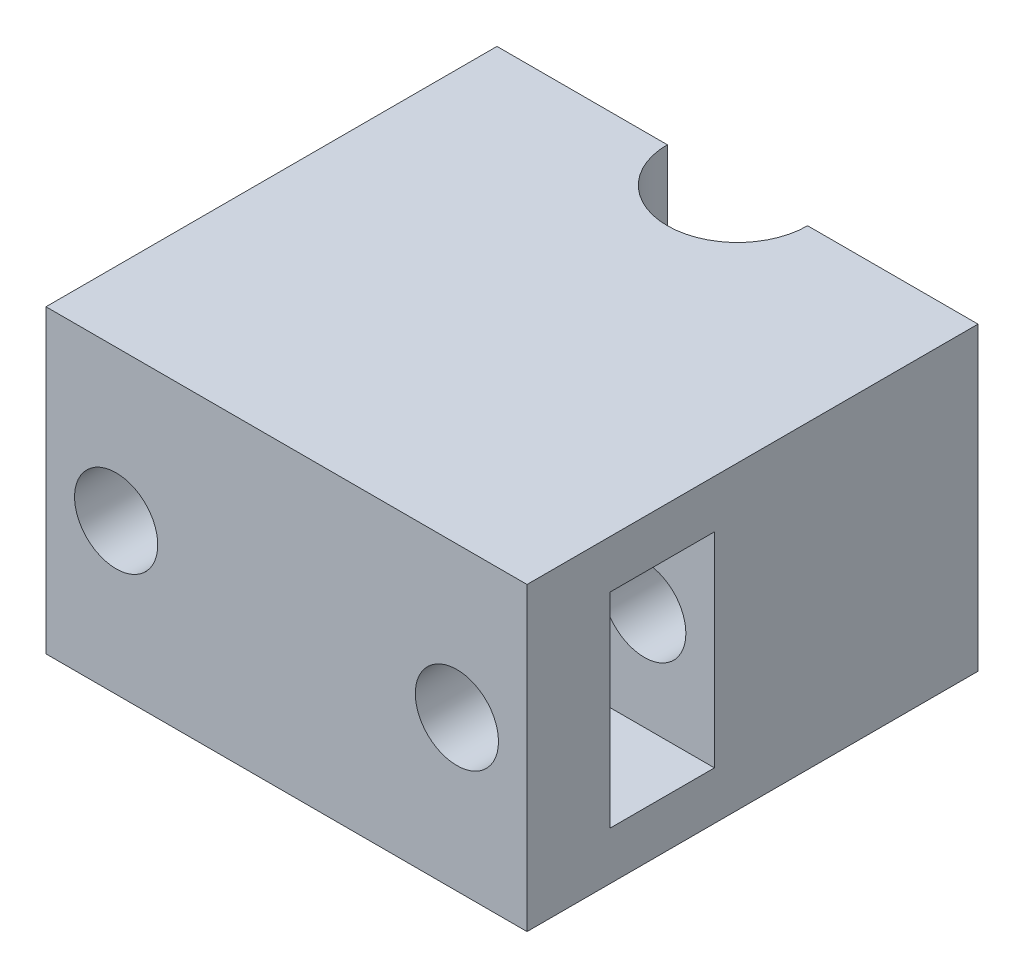
ISO-10303-21;
HEADER;
FILE_DESCRIPTION(('STEP AP214'),'2;1');
FILE_NAME('part.step','',(''),(''),'','','');
FILE_SCHEMA(('AUTOMOTIVE_DESIGN { 1 0 10303 214 1 1 1 1 }'));
ENDSEC;
DATA;
#1=APPLICATION_CONTEXT('core data for automotive mechanical design processes');
#2=APPLICATION_PROTOCOL_DEFINITION('international standard','automotive_design',2000,#1);
#3=PRODUCT_CONTEXT('',#1,'mechanical');
#4=PRODUCT('Part','Part','',(#3));
#5=PRODUCT_RELATED_PRODUCT_CATEGORY('part','',(#4));
#6=PRODUCT_DEFINITION_FORMATION('','',#4);
#7=PRODUCT_DEFINITION_CONTEXT('part definition',#1,'design');
#8=PRODUCT_DEFINITION('design','',#6,#7);
#9=PRODUCT_DEFINITION_SHAPE('','',#8);
#10=(LENGTH_UNIT() NAMED_UNIT(*) SI_UNIT(.MILLI.,.METRE.));
#11=(NAMED_UNIT(*) PLANE_ANGLE_UNIT() SI_UNIT($,.RADIAN.));
#12=(NAMED_UNIT(*) SI_UNIT($,.STERADIAN.) SOLID_ANGLE_UNIT());
#13=UNCERTAINTY_MEASURE_WITH_UNIT(LENGTH_MEASURE(1.E-05),#10,'distance_accuracy_value','');
#14=(GEOMETRIC_REPRESENTATION_CONTEXT(3) GLOBAL_UNCERTAINTY_ASSIGNED_CONTEXT((#13)) GLOBAL_UNIT_ASSIGNED_CONTEXT((#10,
#11,#12)) REPRESENTATION_CONTEXT('',''));
#15=CARTESIAN_POINT('',(0.,0.,0.));
#16=DIRECTION('',(0.,0.,1.));
#17=DIRECTION('',(1.,0.,0.));
#18=AXIS2_PLACEMENT_3D('',#15,#16,#17);
#19=CARTESIAN_POINT('',(24.,30.,-22.5));
#20=DIRECTION('',(0.,0.,1.));
#21=DIRECTION('',(1.,0.,0.));
#22=AXIS2_PLACEMENT_3D('',#19,#20,#21);
#23=PLANE('',#22);
#24=CARTESIAN_POINT('',(-17.,15.,-22.5));
#25=DIRECTION('',(0.,0.,1.));
#26=DIRECTION('',(1.,0.,0.));
#27=AXIS2_PLACEMENT_3D('',#24,#25,#26);
#28=CIRCLE('',#27,4.15);
#29=CARTESIAN_POINT('',(-12.85,15.,-22.5));
#30=VERTEX_POINT('',#29);
#31=EDGE_CURVE('E159',#30,#30,#28,.T.);
#32=ORIENTED_EDGE('',*,*,#31,.T.);
#33=EDGE_LOOP('',(#32));
#34=FACE_BOUND('',#33,.T.);
#35=DIRECTION('',(0.,-1.,0.));
#36=VECTOR('',#35,1.);
#37=CARTESIAN_POINT('',(-7.,137.757696924736,-22.5));
#38=LINE('',#37,#36);
#39=CARTESIAN_POINT('',(-7.,30.,-22.5));
#40=VERTEX_POINT('',#39);
#41=CARTESIAN_POINT('',(-7.,0.,-22.5));
#42=VERTEX_POINT('',#41);
#43=EDGE_CURVE('E140',#40,#42,#38,.T.);
#44=ORIENTED_EDGE('',*,*,#43,.T.);
#45=DIRECTION('',(-1.,0.,0.));
#46=VECTOR('',#45,1.);
#47=CARTESIAN_POINT('',(24.,0.,-22.5));
#48=LINE('',#47,#46);
#49=CARTESIAN_POINT('',(-24.,0.,-22.5));
#50=VERTEX_POINT('',#49);
#51=EDGE_CURVE('E127',#42,#50,#48,.T.);
#52=ORIENTED_EDGE('',*,*,#51,.T.);
#53=DIRECTION('',(0.,-1.,0.));
#54=VECTOR('',#53,1.);
#55=CARTESIAN_POINT('',(-24.,30.,-22.5));
#56=LINE('',#55,#54);
#57=CARTESIAN_POINT('',(-24.,30.,-22.5));
#58=VERTEX_POINT('',#57);
#59=EDGE_CURVE('E211',#58,#50,#56,.T.);
#60=ORIENTED_EDGE('',*,*,#59,.F.);
#61=DIRECTION('',(-1.,0.,0.));
#62=VECTOR('',#61,1.);
#63=CARTESIAN_POINT('',(24.,30.,-22.5));
#64=LINE('',#63,#62);
#65=EDGE_CURVE('E141',#40,#58,#64,.T.);
#66=ORIENTED_EDGE('',*,*,#65,.F.);
#67=EDGE_LOOP('',(#44,#52,#60,#66));
#68=FACE_BOUND('',#67,.T.);
#69=ADVANCED_FACE('F37',(#34,#68),#23,.F.);
#70=CARTESIAN_POINT('',(17.,15.,-22.5));
#71=DIRECTION('',(0.,0.,1.));
#72=DIRECTION('',(1.,0.,0.));
#73=AXIS2_PLACEMENT_3D('',#70,#71,#72);
#74=CIRCLE('',#73,4.15);
#75=CARTESIAN_POINT('',(21.15,15.,-22.5));
#76=VERTEX_POINT('',#75);
#77=EDGE_CURVE('E149',#76,#76,#74,.T.);
#78=ORIENTED_EDGE('',*,*,#77,.T.);
#79=EDGE_LOOP('',(#78));
#80=FACE_BOUND('',#79,.T.);
#81=DIRECTION('',(0.,-1.,0.));
#82=VECTOR('',#81,1.);
#83=CARTESIAN_POINT('',(7.,137.757696924736,-22.5));
#84=LINE('',#83,#82);
#85=CARTESIAN_POINT('',(7.,30.,-22.5));
#86=VERTEX_POINT('',#85);
#87=CARTESIAN_POINT('',(7.,0.,-22.5));
#88=VERTEX_POINT('',#87);
#89=EDGE_CURVE('E60',#86,#88,#84,.T.);
#90=ORIENTED_EDGE('',*,*,#89,.F.);
#91=CARTESIAN_POINT('',(24.,30.,-22.5));
#92=VERTEX_POINT('',#91);
#93=EDGE_CURVE('E209',#92,#86,#64,.T.);
#94=ORIENTED_EDGE('',*,*,#93,.F.);
#95=DIRECTION('',(0.,-1.,0.));
#96=VECTOR('',#95,1.);
#97=CARTESIAN_POINT('',(24.,30.,-22.5));
#98=LINE('',#97,#96);
#99=CARTESIAN_POINT('',(24.,0.,-22.5));
#100=VERTEX_POINT('',#99);
#101=EDGE_CURVE('E217',#92,#100,#98,.T.);
#102=ORIENTED_EDGE('',*,*,#101,.T.);
#103=EDGE_CURVE('E136',#100,#88,#48,.T.);
#104=ORIENTED_EDGE('',*,*,#103,.T.);
#105=EDGE_LOOP('',(#90,#94,#102,#104));
#106=FACE_BOUND('',#105,.T.);
#107=ADVANCED_FACE('F250',(#80,#106),#23,.F.);
#108=CARTESIAN_POINT('',(0.,30.,0.));
#109=DIRECTION('',(0.,1.,0.));
#110=DIRECTION('',(0.,0.,1.));
#111=AXIS2_PLACEMENT_3D('',#108,#109,#110);
#112=PLANE('',#111);
#113=ORIENTED_EDGE('',*,*,#93,.T.);
#114=CARTESIAN_POINT('',(0.,30.,-22.5));
#115=DIRECTION('',(0.,1.,0.));
#116=DIRECTION('',(0.,0.,1.));
#117=AXIS2_PLACEMENT_3D('',#114,#115,#116);
#118=CIRCLE('',#117,7.);
#119=EDGE_CURVE('E52',#86,#40,#118,.F.);
#120=ORIENTED_EDGE('',*,*,#119,.T.);
#121=ORIENTED_EDGE('',*,*,#65,.T.);
#122=DIRECTION('',(0.,0.,1.));
#123=VECTOR('',#122,1.);
#124=CARTESIAN_POINT('',(-24.,30.,22.5));
#125=LINE('',#124,#123);
#126=CARTESIAN_POINT('',(-24.,30.,22.5));
#127=VERTEX_POINT('',#126);
#128=EDGE_CURVE('E202',#58,#127,#125,.T.);
#129=ORIENTED_EDGE('',*,*,#128,.T.);
#130=DIRECTION('',(1.,0.,0.));
#131=VECTOR('',#130,1.);
#132=CARTESIAN_POINT('',(24.,30.,22.5));
#133=LINE('',#132,#131);
#134=CARTESIAN_POINT('',(24.,30.,22.5));
#135=VERTEX_POINT('',#134);
#136=EDGE_CURVE('E205',#127,#135,#133,.T.);
#137=ORIENTED_EDGE('',*,*,#136,.T.);
#138=DIRECTION('',(0.,0.,-1.));
#139=VECTOR('',#138,1.);
#140=CARTESIAN_POINT('',(24.,30.,22.5));
#141=LINE('',#140,#139);
#142=EDGE_CURVE('E207',#135,#92,#141,.T.);
#143=ORIENTED_EDGE('',*,*,#142,.T.);
#144=EDGE_LOOP('',(#113,#120,#121,#129,#137,#143));
#145=FACE_BOUND('',#144,.T.);
#146=ADVANCED_FACE('F256',(#145),#112,.T.);
#147=CARTESIAN_POINT('',(0.,0.,0.));
#148=DIRECTION('',(0.,1.,0.));
#149=DIRECTION('',(0.,0.,1.));
#150=AXIS2_PLACEMENT_3D('',#147,#148,#149);
#151=PLANE('',#150);
#152=CARTESIAN_POINT('',(0.,0.,-22.5));
#153=DIRECTION('',(0.,1.,0.));
#154=DIRECTION('',(0.,0.,1.));
#155=AXIS2_PLACEMENT_3D('',#152,#153,#154);
#156=CIRCLE('',#155,7.);
#157=EDGE_CURVE('E12',#88,#42,#156,.F.);
#158=ORIENTED_EDGE('',*,*,#157,.F.);
#159=ORIENTED_EDGE('',*,*,#103,.F.);
#160=DIRECTION('',(0.,0.,-1.));
#161=VECTOR('',#160,1.);
#162=CARTESIAN_POINT('',(24.,0.,22.5));
#163=LINE('',#162,#161);
#164=CARTESIAN_POINT('',(24.,0.,22.5));
#165=VERTEX_POINT('',#164);
#166=EDGE_CURVE('E137',#165,#100,#163,.T.);
#167=ORIENTED_EDGE('',*,*,#166,.F.);
#168=DIRECTION('',(1.,0.,0.));
#169=VECTOR('',#168,1.);
#170=CARTESIAN_POINT('',(24.,0.,22.5));
#171=LINE('',#170,#169);
#172=CARTESIAN_POINT('',(-24.,0.,22.5));
#173=VERTEX_POINT('',#172);
#174=EDGE_CURVE('E213',#173,#165,#171,.T.);
#175=ORIENTED_EDGE('',*,*,#174,.F.);
#176=DIRECTION('',(0.,0.,1.));
#177=VECTOR('',#176,1.);
#178=CARTESIAN_POINT('',(-24.,0.,22.5));
#179=LINE('',#178,#177);
#180=EDGE_CURVE('E132',#50,#173,#179,.T.);
#181=ORIENTED_EDGE('',*,*,#180,.F.);
#182=ORIENTED_EDGE('',*,*,#51,.F.);
#183=EDGE_LOOP('',(#158,#159,#167,#175,#181,#182));
#184=FACE_BOUND('',#183,.T.);
#185=ADVANCED_FACE('F129',(#184),#151,.F.);
#186=CARTESIAN_POINT('',(-21.,30.,22.5));
#187=DIRECTION('',(1.,0.,0.));
#188=DIRECTION('',(0.,0.,-1.));
#189=AXIS2_PLACEMENT_3D('',#186,#187,#188);
#190=PLANE('',#189);
#191=DIRECTION('',(0.,0.,1.));
#192=VECTOR('',#191,1.);
#193=CARTESIAN_POINT('',(-21.,16.1056672193749,-22.5));
#194=LINE('',#193,#192);
#195=CARTESIAN_POINT('',(-21.,16.1056672193749,3.80000000000001));
#196=VERTEX_POINT('',#195);
#197=CARTESIAN_POINT('',(-21.,16.1056672193749,14.2));
#198=VERTEX_POINT('',#197);
#199=EDGE_CURVE('E45',#196,#198,#194,.T.);
#200=ORIENTED_EDGE('',*,*,#199,.F.);
#201=DIRECTION('',(0.,-1.,0.));
#202=VECTOR('',#201,1.);
#203=CARTESIAN_POINT('',(-21.,4.8,3.80000000000001));
#204=LINE('',#203,#202);
#205=CARTESIAN_POINT('',(-21.,25.2,3.80000000000001));
#206=VERTEX_POINT('',#205);
#207=EDGE_CURVE('E178',#206,#196,#204,.T.);
#208=ORIENTED_EDGE('',*,*,#207,.F.);
#209=DIRECTION('',(0.,0.,-1.));
#210=VECTOR('',#209,1.);
#211=CARTESIAN_POINT('',(-21.,25.2,14.2));
#212=LINE('',#211,#210);
#213=CARTESIAN_POINT('',(-21.,25.2,14.2));
#214=VERTEX_POINT('',#213);
#215=EDGE_CURVE('E181',#214,#206,#212,.T.);
#216=ORIENTED_EDGE('',*,*,#215,.F.);
#217=DIRECTION('',(0.,1.,0.));
#218=VECTOR('',#217,1.);
#219=CARTESIAN_POINT('',(-21.,4.8,14.2));
#220=LINE('',#219,#218);
#221=EDGE_CURVE('E175',#198,#214,#220,.T.);
#222=ORIENTED_EDGE('',*,*,#221,.F.);
#223=EDGE_LOOP('',(#200,#208,#216,#222));
#224=FACE_BOUND('',#223,.T.);
#225=ADVANCED_FACE('F271',(#224),#190,.T.);
#226=CARTESIAN_POINT('',(-24.,30.,22.5));
#227=DIRECTION('',(1.,0.,0.));
#228=DIRECTION('',(0.,0.,-1.));
#229=AXIS2_PLACEMENT_3D('',#226,#227,#228);
#230=PLANE('',#229);
#231=ORIENTED_EDGE('',*,*,#180,.T.);
#232=DIRECTION('',(0.,-1.,0.));
#233=VECTOR('',#232,1.);
#234=CARTESIAN_POINT('',(-24.,30.,22.5));
#235=LINE('',#234,#233);
#236=EDGE_CURVE('E223',#127,#173,#235,.T.);
#237=ORIENTED_EDGE('',*,*,#236,.F.);
#238=ORIENTED_EDGE('',*,*,#128,.F.);
#239=ORIENTED_EDGE('',*,*,#59,.T.);
#240=EDGE_LOOP('',(#231,#237,#238,#239));
#241=FACE_BOUND('',#240,.T.);
#242=ADVANCED_FACE('F39',(#241),#230,.F.);
#243=CARTESIAN_POINT('',(24.,30.,22.5));
#244=DIRECTION('',(0.,0.,-1.));
#245=DIRECTION('',(-1.,0.,0.));
#246=AXIS2_PLACEMENT_3D('',#243,#244,#245);
#247=PLANE('',#246);
#248=CARTESIAN_POINT('',(17.,15.,22.5));
#249=DIRECTION('',(0.,0.,1.));
#250=DIRECTION('',(1.,0.,0.));
#251=AXIS2_PLACEMENT_3D('',#248,#249,#250);
#252=CIRCLE('',#251,4.15);
#253=CARTESIAN_POINT('',(21.15,15.,22.5));
#254=VERTEX_POINT('',#253);
#255=EDGE_CURVE('E146',#254,#254,#252,.T.);
#256=ORIENTED_EDGE('',*,*,#255,.F.);
#257=EDGE_LOOP('',(#256));
#258=FACE_BOUND('',#257,.T.);
#259=CARTESIAN_POINT('',(-17.,15.,22.5));
#260=DIRECTION('',(0.,0.,1.));
#261=DIRECTION('',(1.,0.,0.));
#262=AXIS2_PLACEMENT_3D('',#259,#260,#261);
#263=CIRCLE('',#262,4.15);
#264=CARTESIAN_POINT('',(-12.85,15.,22.5));
#265=VERTEX_POINT('',#264);
#266=EDGE_CURVE('E158',#265,#265,#263,.T.);
#267=ORIENTED_EDGE('',*,*,#266,.F.);
#268=EDGE_LOOP('',(#267));
#269=FACE_BOUND('',#268,.T.);
#270=ORIENTED_EDGE('',*,*,#174,.T.);
#271=DIRECTION('',(0.,-1.,0.));
#272=VECTOR('',#271,1.);
#273=CARTESIAN_POINT('',(24.,30.,22.5));
#274=LINE('',#273,#272);
#275=EDGE_CURVE('E220',#135,#165,#274,.T.);
#276=ORIENTED_EDGE('',*,*,#275,.F.);
#277=ORIENTED_EDGE('',*,*,#136,.F.);
#278=ORIENTED_EDGE('',*,*,#236,.T.);
#279=EDGE_LOOP('',(#270,#276,#277,#278));
#280=FACE_BOUND('',#279,.T.);
#281=ADVANCED_FACE('F264',(#258,#269,#280),#247,.F.);
#282=CARTESIAN_POINT('',(24.,30.,22.5));
#283=DIRECTION('',(-1.,0.,0.));
#284=DIRECTION('',(0.,0.,1.));
#285=AXIS2_PLACEMENT_3D('',#282,#283,#284);
#286=PLANE('',#285);
#287=DIRECTION('',(0.,0.,1.));
#288=VECTOR('',#287,1.);
#289=CARTESIAN_POINT('',(24.,25.2,14.2));
#290=LINE('',#289,#288);
#291=CARTESIAN_POINT('',(24.,25.2,3.80000000000001));
#292=VERTEX_POINT('',#291);
#293=CARTESIAN_POINT('',(24.,25.2,14.2));
#294=VERTEX_POINT('',#293);
#295=EDGE_CURVE('E183',#292,#294,#290,.T.);
#296=ORIENTED_EDGE('',*,*,#295,.F.);
#297=DIRECTION('',(0.,1.,0.));
#298=VECTOR('',#297,1.);
#299=CARTESIAN_POINT('',(24.,4.8,3.80000000000001));
#300=LINE('',#299,#298);
#301=CARTESIAN_POINT('',(24.,4.8,3.80000000000001));
#302=VERTEX_POINT('',#301);
#303=EDGE_CURVE('E170',#302,#292,#300,.T.);
#304=ORIENTED_EDGE('',*,*,#303,.F.);
#305=DIRECTION('',(0.,0.,-1.));
#306=VECTOR('',#305,1.);
#307=CARTESIAN_POINT('',(24.,4.8,14.2));
#308=LINE('',#307,#306);
#309=CARTESIAN_POINT('',(24.,4.8,14.2));
#310=VERTEX_POINT('',#309);
#311=EDGE_CURVE('E189',#310,#302,#308,.T.);
#312=ORIENTED_EDGE('',*,*,#311,.F.);
#313=DIRECTION('',(0.,-1.,0.));
#314=VECTOR('',#313,1.);
#315=CARTESIAN_POINT('',(24.,4.8,14.2));
#316=LINE('',#315,#314);
#317=EDGE_CURVE('E186',#294,#310,#316,.T.);
#318=ORIENTED_EDGE('',*,*,#317,.F.);
#319=EDGE_LOOP('',(#296,#304,#312,#318));
#320=FACE_BOUND('',#319,.T.);
#321=ORIENTED_EDGE('',*,*,#166,.T.);
#322=ORIENTED_EDGE('',*,*,#101,.F.);
#323=ORIENTED_EDGE('',*,*,#142,.F.);
#324=ORIENTED_EDGE('',*,*,#275,.T.);
#325=EDGE_LOOP('',(#321,#322,#323,#324));
#326=FACE_BOUND('',#325,.T.);
#327=ADVANCED_FACE('F261',(#320,#326),#286,.F.);
#328=CARTESIAN_POINT('',(-46.8980348501787,4.8,3.80000000000001));
#329=DIRECTION('',(0.,0.,-1.));
#330=DIRECTION('',(-1.,0.,0.));
#331=AXIS2_PLACEMENT_3D('',#328,#329,#330);
#332=PLANE('',#331);
#333=CARTESIAN_POINT('',(17.,15.,3.80000000000001));
#334=DIRECTION('',(0.,0.,-1.));
#335=DIRECTION('',(-1.,0.,0.));
#336=AXIS2_PLACEMENT_3D('',#333,#334,#335);
#337=CIRCLE('',#336,4.15);
#338=CARTESIAN_POINT('',(12.85,15.,3.80000000000001));
#339=VERTEX_POINT('',#338);
#340=EDGE_CURVE('E155',#339,#339,#337,.T.);
#341=ORIENTED_EDGE('',*,*,#340,.T.);
#342=EDGE_LOOP('',(#341));
#343=FACE_BOUND('',#342,.T.);
#344=ORIENTED_EDGE('',*,*,#207,.T.);
#345=CARTESIAN_POINT('',(-17.,15.,3.80000000000001));
#346=DIRECTION('',(0.,0.,-1.));
#347=DIRECTION('',(-1.,0.,0.));
#348=AXIS2_PLACEMENT_3D('',#345,#346,#347);
#349=CIRCLE('',#348,4.15);
#350=CARTESIAN_POINT('',(-21.,13.8943327806251,3.80000000000001));
#351=VERTEX_POINT('',#350);
#352=EDGE_CURVE('E167',#196,#351,#349,.T.);
#353=ORIENTED_EDGE('',*,*,#352,.T.);
#354=CARTESIAN_POINT('',(-21.,4.8,3.80000000000001));
#355=VERTEX_POINT('',#354);
#356=EDGE_CURVE('E177',#351,#355,#204,.T.);
#357=ORIENTED_EDGE('',*,*,#356,.T.);
#358=DIRECTION('',(1.,0.,0.));
#359=VECTOR('',#358,1.);
#360=CARTESIAN_POINT('',(-46.8980348501787,4.8,3.80000000000001));
#361=LINE('',#360,#359);
#362=EDGE_CURVE('E193',#355,#302,#361,.T.);
#363=ORIENTED_EDGE('',*,*,#362,.T.);
#364=ORIENTED_EDGE('',*,*,#303,.T.);
#365=DIRECTION('',(1.,0.,0.));
#366=VECTOR('',#365,1.);
#367=CARTESIAN_POINT('',(-46.8980348501787,25.2,3.80000000000001));
#368=LINE('',#367,#366);
#369=EDGE_CURVE('E192',#206,#292,#368,.T.);
#370=ORIENTED_EDGE('',*,*,#369,.F.);
#371=EDGE_LOOP('',(#344,#353,#357,#363,#364,#370));
#372=FACE_BOUND('',#371,.T.);
#373=ADVANCED_FACE('F263',(#343,#372),#332,.F.);
#374=CARTESIAN_POINT('',(-46.8980348501787,4.8,14.2));
#375=DIRECTION('',(0.,-1.,0.));
#376=DIRECTION('',(0.,0.,-1.));
#377=AXIS2_PLACEMENT_3D('',#374,#375,#376);
#378=PLANE('',#377);
#379=DIRECTION('',(0.,0.,1.));
#380=VECTOR('',#379,1.);
#381=CARTESIAN_POINT('',(-21.,4.8,14.2));
#382=LINE('',#381,#380);
#383=CARTESIAN_POINT('',(-21.,4.8,14.2));
#384=VERTEX_POINT('',#383);
#385=EDGE_CURVE('E174',#355,#384,#382,.T.);
#386=ORIENTED_EDGE('',*,*,#385,.T.);
#387=DIRECTION('',(1.,0.,0.));
#388=VECTOR('',#387,1.);
#389=CARTESIAN_POINT('',(-46.8980348501787,4.8,14.2));
#390=LINE('',#389,#388);
#391=EDGE_CURVE('E195',#384,#310,#390,.T.);
#392=ORIENTED_EDGE('',*,*,#391,.T.);
#393=ORIENTED_EDGE('',*,*,#311,.T.);
#394=ORIENTED_EDGE('',*,*,#362,.F.);
#395=EDGE_LOOP('',(#386,#392,#393,#394));
#396=FACE_BOUND('',#395,.T.);
#397=ADVANCED_FACE('F291',(#396),#378,.F.);
#398=CARTESIAN_POINT('',(-46.8980348501787,4.8,14.2));
#399=DIRECTION('',(0.,0.,1.));
#400=DIRECTION('',(1.,0.,0.));
#401=AXIS2_PLACEMENT_3D('',#398,#399,#400);
#402=PLANE('',#401);
#403=CARTESIAN_POINT('',(17.,15.,14.2));
#404=DIRECTION('',(0.,0.,1.));
#405=DIRECTION('',(1.,0.,0.));
#406=AXIS2_PLACEMENT_3D('',#403,#404,#405);
#407=CIRCLE('',#406,4.15);
#408=CARTESIAN_POINT('',(21.15,15.,14.2));
#409=VERTEX_POINT('',#408);
#410=EDGE_CURVE('E152',#409,#409,#407,.T.);
#411=ORIENTED_EDGE('',*,*,#410,.T.);
#412=EDGE_LOOP('',(#411));
#413=FACE_BOUND('',#412,.T.);
#414=CARTESIAN_POINT('',(-21.,13.8943327806251,14.2));
#415=VERTEX_POINT('',#414);
#416=EDGE_CURVE('E171',#384,#415,#220,.T.);
#417=ORIENTED_EDGE('',*,*,#416,.T.);
#418=CARTESIAN_POINT('',(-17.,15.,14.2));
#419=DIRECTION('',(0.,0.,1.));
#420=DIRECTION('',(1.,0.,0.));
#421=AXIS2_PLACEMENT_3D('',#418,#419,#420);
#422=CIRCLE('',#421,4.15);
#423=EDGE_CURVE('E162',#415,#198,#422,.T.);
#424=ORIENTED_EDGE('',*,*,#423,.T.);
#425=ORIENTED_EDGE('',*,*,#221,.T.);
#426=DIRECTION('',(1.,0.,0.));
#427=VECTOR('',#426,1.);
#428=CARTESIAN_POINT('',(-46.8980348501787,25.2,14.2));
#429=LINE('',#428,#427);
#430=EDGE_CURVE('E197',#214,#294,#429,.T.);
#431=ORIENTED_EDGE('',*,*,#430,.T.);
#432=ORIENTED_EDGE('',*,*,#317,.T.);
#433=ORIENTED_EDGE('',*,*,#391,.F.);
#434=EDGE_LOOP('',(#417,#424,#425,#431,#432,#433));
#435=FACE_BOUND('',#434,.T.);
#436=ADVANCED_FACE('F231',(#413,#435),#402,.F.);
#437=CARTESIAN_POINT('',(-46.8980348501787,25.2,14.2));
#438=DIRECTION('',(0.,1.,0.));
#439=DIRECTION('',(0.,0.,1.));
#440=AXIS2_PLACEMENT_3D('',#437,#438,#439);
#441=PLANE('',#440);
#442=ORIENTED_EDGE('',*,*,#215,.T.);
#443=ORIENTED_EDGE('',*,*,#369,.T.);
#444=ORIENTED_EDGE('',*,*,#295,.T.);
#445=ORIENTED_EDGE('',*,*,#430,.F.);
#446=EDGE_LOOP('',(#442,#443,#444,#445));
#447=FACE_BOUND('',#446,.T.);
#448=ADVANCED_FACE('F293',(#447),#441,.F.);
#449=DIRECTION('',(0.,0.,1.));
#450=VECTOR('',#449,1.);
#451=CARTESIAN_POINT('',(-21.,13.8943327806251,-22.5));
#452=LINE('',#451,#450);
#453=EDGE_CURVE('E226',#415,#351,#452,.F.);
#454=ORIENTED_EDGE('',*,*,#453,.F.);
#455=ORIENTED_EDGE('',*,*,#416,.F.);
#456=ORIENTED_EDGE('',*,*,#385,.F.);
#457=ORIENTED_EDGE('',*,*,#356,.F.);
#458=EDGE_LOOP('',(#454,#455,#456,#457));
#459=FACE_BOUND('',#458,.T.);
#460=ADVANCED_FACE('F245',(#459),#190,.T.);
#461=CARTESIAN_POINT('',(-17.,15.,-22.5));
#462=DIRECTION('',(0.,0.,1.));
#463=DIRECTION('',(1.,0.,0.));
#464=AXIS2_PLACEMENT_3D('',#461,#462,#463);
#465=CYLINDRICAL_SURFACE('',#464,4.15);
#466=ORIENTED_EDGE('',*,*,#199,.T.);
#467=ORIENTED_EDGE('',*,*,#423,.F.);
#468=ORIENTED_EDGE('',*,*,#453,.T.);
#469=ORIENTED_EDGE('',*,*,#352,.F.);
#470=EDGE_LOOP('',(#466,#467,#468,#469));
#471=FACE_BOUND('',#470,.T.);
#472=ORIENTED_EDGE('',*,*,#31,.F.);
#473=EDGE_LOOP('',(#472));
#474=FACE_BOUND('',#473,.T.);
#475=ORIENTED_EDGE('',*,*,#266,.T.);
#476=EDGE_LOOP('',(#475));
#477=FACE_BOUND('',#476,.T.);
#478=ADVANCED_FACE('F237',(#471,#474,#477),#465,.F.);
#479=CARTESIAN_POINT('',(17.,15.,-22.5));
#480=DIRECTION('',(0.,0.,1.));
#481=DIRECTION('',(1.,0.,0.));
#482=AXIS2_PLACEMENT_3D('',#479,#480,#481);
#483=CYLINDRICAL_SURFACE('',#482,4.15);
#484=ORIENTED_EDGE('',*,*,#255,.T.);
#485=EDGE_LOOP('',(#484));
#486=FACE_BOUND('',#485,.T.);
#487=ORIENTED_EDGE('',*,*,#410,.F.);
#488=EDGE_LOOP('',(#487));
#489=FACE_BOUND('',#488,.T.);
#490=ADVANCED_FACE('F234',(#486,#489),#483,.F.);
#491=ORIENTED_EDGE('',*,*,#77,.F.);
#492=EDGE_LOOP('',(#491));
#493=FACE_BOUND('',#492,.T.);
#494=ORIENTED_EDGE('',*,*,#340,.F.);
#495=EDGE_LOOP('',(#494));
#496=FACE_BOUND('',#495,.T.);
#497=ADVANCED_FACE('F236',(#493,#496),#483,.F.);
#498=CARTESIAN_POINT('',(0.,137.757696924736,-22.5));
#499=DIRECTION('',(0.,-1.,0.));
#500=DIRECTION('',(0.,0.,-1.));
#501=AXIS2_PLACEMENT_3D('',#498,#499,#500);
#502=CYLINDRICAL_SURFACE('',#501,7.);
#503=ORIENTED_EDGE('',*,*,#119,.F.);
#504=ORIENTED_EDGE('',*,*,#89,.T.);
#505=ORIENTED_EDGE('',*,*,#157,.T.);
#506=ORIENTED_EDGE('',*,*,#43,.F.);
#507=EDGE_LOOP('',(#503,#504,#505,#506));
#508=FACE_BOUND('',#507,.T.);
#509=ADVANCED_FACE('F144',(#508),#502,.F.);
#510=CLOSED_SHELL('',(#69,#107,#146,#185,#225,#242,#281,#327,#373,#397,#436,#448,#460,#478,#490,
#497,#509));
#511=MANIFOLD_SOLID_BREP('B2',#510);
#512=ADVANCED_BREP_SHAPE_REPRESENTATION('',(#18,#511),#14);
#513=SHAPE_DEFINITION_REPRESENTATION(#9,#512);
ENDSEC;
END-ISO-10303-21;
